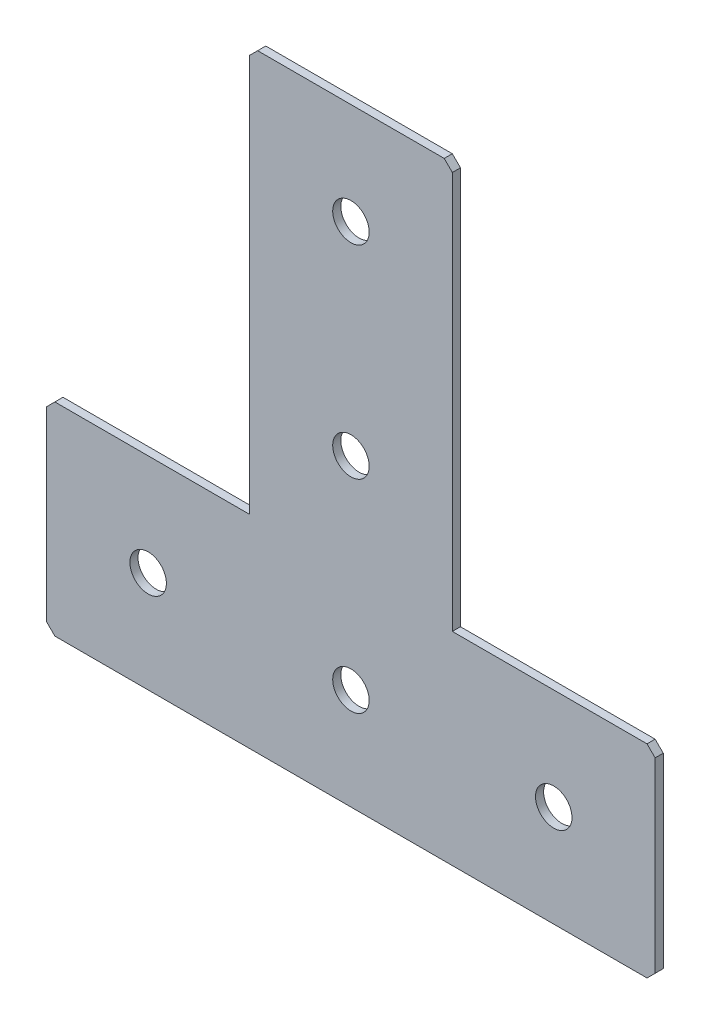
ISO-10303-21;
HEADER;
FILE_DESCRIPTION(('STEP AP214'),'2;1');
FILE_NAME('part.step','',(''),(''),'','','');
FILE_SCHEMA(('AUTOMOTIVE_DESIGN { 1 0 10303 214 1 1 1 1 }'));
ENDSEC;
DATA;
#1=APPLICATION_CONTEXT('core data for automotive mechanical design processes');
#2=APPLICATION_PROTOCOL_DEFINITION('international standard','automotive_design',2000,#1);
#3=PRODUCT_CONTEXT('',#1,'mechanical');
#4=PRODUCT('Part','Part','',(#3));
#5=PRODUCT_RELATED_PRODUCT_CATEGORY('part','',(#4));
#6=PRODUCT_DEFINITION_FORMATION('','',#4);
#7=PRODUCT_DEFINITION_CONTEXT('part definition',#1,'design');
#8=PRODUCT_DEFINITION('design','',#6,#7);
#9=PRODUCT_DEFINITION_SHAPE('','',#8);
#10=(LENGTH_UNIT() NAMED_UNIT(*) SI_UNIT(.MILLI.,.METRE.));
#11=(NAMED_UNIT(*) PLANE_ANGLE_UNIT() SI_UNIT($,.RADIAN.));
#12=(NAMED_UNIT(*) SI_UNIT($,.STERADIAN.) SOLID_ANGLE_UNIT());
#13=UNCERTAINTY_MEASURE_WITH_UNIT(LENGTH_MEASURE(1.E-05),#10,'distance_accuracy_value','');
#14=(GEOMETRIC_REPRESENTATION_CONTEXT(3) GLOBAL_UNCERTAINTY_ASSIGNED_CONTEXT((#13)) GLOBAL_UNIT_ASSIGNED_CONTEXT((#10,
#11,#12)) REPRESENTATION_CONTEXT('',''));
#15=CARTESIAN_POINT('',(0.,0.,0.));
#16=DIRECTION('',(0.,0.,1.));
#17=DIRECTION('',(1.,0.,0.));
#18=AXIS2_PLACEMENT_3D('',#15,#16,#17);
#19=CARTESIAN_POINT('',(-25.,-100.,-2.));
#20=DIRECTION('',(1.,0.,0.));
#21=DIRECTION('',(0.,1.,0.));
#22=AXIS2_PLACEMENT_3D('',#19,#20,#21);
#23=PLANE('',#22);
#24=DIRECTION('',(0.,1.,0.));
#25=VECTOR('',#24,1.);
#26=CARTESIAN_POINT('',(-25.,-100.,0.));
#27=LINE('',#26,#25);
#28=CARTESIAN_POINT('',(-25.,-100.,0.));
#29=VERTEX_POINT('',#28);
#30=CARTESIAN_POINT('',(-25.,-2.,0.));
#31=VERTEX_POINT('',#30);
#32=EDGE_CURVE('E188',#29,#31,#27,.T.);
#33=ORIENTED_EDGE('',*,*,#32,.T.);
#34=DIRECTION('',(0.,0.,-1.));
#35=VECTOR('',#34,1.);
#36=CARTESIAN_POINT('',(-25.,-2.,-2.));
#37=LINE('',#36,#35);
#38=CARTESIAN_POINT('',(-25.,-2.,-2.));
#39=VERTEX_POINT('',#38);
#40=EDGE_CURVE('E278',#31,#39,#37,.T.);
#41=ORIENTED_EDGE('',*,*,#40,.T.);
#42=DIRECTION('',(0.,1.,0.));
#43=VECTOR('',#42,1.);
#44=CARTESIAN_POINT('',(-25.,-100.,-2.));
#45=LINE('',#44,#43);
#46=CARTESIAN_POINT('',(-25.,-100.,-2.));
#47=VERTEX_POINT('',#46);
#48=EDGE_CURVE('E216',#47,#39,#45,.T.);
#49=ORIENTED_EDGE('',*,*,#48,.F.);
#50=DIRECTION('',(0.,0.,1.));
#51=VECTOR('',#50,1.);
#52=CARTESIAN_POINT('',(-25.,-100.,-2.));
#53=LINE('',#52,#51);
#54=EDGE_CURVE('E168',#47,#29,#53,.T.);
#55=ORIENTED_EDGE('',*,*,#54,.T.);
#56=EDGE_LOOP('',(#33,#41,#49,#55));
#57=FACE_BOUND('',#56,.T.);
#58=ADVANCED_FACE('F39',(#57),#23,.F.);
#59=CARTESIAN_POINT('',(25.,0.,-2.));
#60=DIRECTION('',(0.,-1.,0.));
#61=DIRECTION('',(1.,0.,0.));
#62=AXIS2_PLACEMENT_3D('',#59,#60,#61);
#63=PLANE('',#62);
#64=DIRECTION('',(1.,0.,0.));
#65=VECTOR('',#64,1.);
#66=CARTESIAN_POINT('',(25.,0.,-2.));
#67=LINE('',#66,#65);
#68=CARTESIAN_POINT('',(-23.,0.,-2.));
#69=VERTEX_POINT('',#68);
#70=CARTESIAN_POINT('',(23.,0.,-2.));
#71=VERTEX_POINT('',#70);
#72=EDGE_CURVE('E156',#69,#71,#67,.T.);
#73=ORIENTED_EDGE('',*,*,#72,.F.);
#74=DIRECTION('',(0.,0.,1.));
#75=VECTOR('',#74,1.);
#76=CARTESIAN_POINT('',(-23.,0.,-2.));
#77=LINE('',#76,#75);
#78=CARTESIAN_POINT('',(-23.,0.,0.));
#79=VERTEX_POINT('',#78);
#80=EDGE_CURVE('E274',#69,#79,#77,.T.);
#81=ORIENTED_EDGE('',*,*,#80,.T.);
#82=DIRECTION('',(1.,0.,0.));
#83=VECTOR('',#82,1.);
#84=CARTESIAN_POINT('',(25.,0.,0.));
#85=LINE('',#84,#83);
#86=CARTESIAN_POINT('',(23.,0.,0.));
#87=VERTEX_POINT('',#86);
#88=EDGE_CURVE('E192',#79,#87,#85,.T.);
#89=ORIENTED_EDGE('',*,*,#88,.T.);
#90=DIRECTION('',(0.,0.,-1.));
#91=VECTOR('',#90,1.);
#92=CARTESIAN_POINT('',(23.,0.,-2.));
#93=LINE('',#92,#91);
#94=EDGE_CURVE('E271',#87,#71,#93,.T.);
#95=ORIENTED_EDGE('',*,*,#94,.T.);
#96=EDGE_LOOP('',(#73,#81,#89,#95));
#97=FACE_BOUND('',#96,.T.);
#98=ADVANCED_FACE('F331',(#97),#63,.F.);
#99=CARTESIAN_POINT('',(25.,-100.,-2.));
#100=DIRECTION('',(-1.,0.,0.));
#101=DIRECTION('',(0.,-1.,0.));
#102=AXIS2_PLACEMENT_3D('',#99,#100,#101);
#103=PLANE('',#102);
#104=DIRECTION('',(0.,-1.,0.));
#105=VECTOR('',#104,1.);
#106=CARTESIAN_POINT('',(25.,-100.,-2.));
#107=LINE('',#106,#105);
#108=CARTESIAN_POINT('',(25.,-2.00000000000003,-2.));
#109=VERTEX_POINT('',#108);
#110=CARTESIAN_POINT('',(25.,-100.,-2.));
#111=VERTEX_POINT('',#110);
#112=EDGE_CURVE('E142',#109,#111,#107,.T.);
#113=ORIENTED_EDGE('',*,*,#112,.F.);
#114=DIRECTION('',(0.,0.,1.));
#115=VECTOR('',#114,1.);
#116=CARTESIAN_POINT('',(25.,-2.00000000000003,-2.));
#117=LINE('',#116,#115);
#118=CARTESIAN_POINT('',(25.,-2.00000000000003,0.));
#119=VERTEX_POINT('',#118);
#120=EDGE_CURVE('E281',#109,#119,#117,.T.);
#121=ORIENTED_EDGE('',*,*,#120,.T.);
#122=DIRECTION('',(0.,-1.,0.));
#123=VECTOR('',#122,1.);
#124=CARTESIAN_POINT('',(25.,-100.,0.));
#125=LINE('',#124,#123);
#126=CARTESIAN_POINT('',(25.,-100.,0.));
#127=VERTEX_POINT('',#126);
#128=EDGE_CURVE('E162',#119,#127,#125,.T.);
#129=ORIENTED_EDGE('',*,*,#128,.T.);
#130=DIRECTION('',(0.,0.,1.));
#131=VECTOR('',#130,1.);
#132=CARTESIAN_POINT('',(25.,-100.,-2.));
#133=LINE('',#132,#131);
#134=EDGE_CURVE('E159',#111,#127,#133,.T.);
#135=ORIENTED_EDGE('',*,*,#134,.F.);
#136=EDGE_LOOP('',(#113,#121,#129,#135));
#137=FACE_BOUND('',#136,.T.);
#138=ADVANCED_FACE('F160',(#137),#103,.F.);
#139=CARTESIAN_POINT('',(75.,-100.,-2.));
#140=DIRECTION('',(0.,-1.,0.));
#141=DIRECTION('',(0.,0.,-1.));
#142=AXIS2_PLACEMENT_3D('',#139,#140,#141);
#143=PLANE('',#142);
#144=DIRECTION('',(1.,0.,0.));
#145=VECTOR('',#144,1.);
#146=CARTESIAN_POINT('',(75.,-100.,0.));
#147=LINE('',#146,#145);
#148=CARTESIAN_POINT('',(73.,-100.,0.));
#149=VERTEX_POINT('',#148);
#150=EDGE_CURVE('E199',#127,#149,#147,.T.);
#151=ORIENTED_EDGE('',*,*,#150,.T.);
#152=DIRECTION('',(0.,0.,-1.));
#153=VECTOR('',#152,1.);
#154=CARTESIAN_POINT('',(73.,-100.,-2.));
#155=LINE('',#154,#153);
#156=CARTESIAN_POINT('',(73.,-100.,-2.));
#157=VERTEX_POINT('',#156);
#158=EDGE_CURVE('E11',#149,#157,#155,.T.);
#159=ORIENTED_EDGE('',*,*,#158,.T.);
#160=DIRECTION('',(1.,0.,0.));
#161=VECTOR('',#160,1.);
#162=CARTESIAN_POINT('',(75.,-100.,-2.));
#163=LINE('',#162,#161);
#164=EDGE_CURVE('E147',#111,#157,#163,.T.);
#165=ORIENTED_EDGE('',*,*,#164,.F.);
#166=ORIENTED_EDGE('',*,*,#134,.T.);
#167=EDGE_LOOP('',(#151,#159,#165,#166));
#168=FACE_BOUND('',#167,.T.);
#169=ADVANCED_FACE('F170',(#168),#143,.F.);
#170=CARTESIAN_POINT('',(75.,-150.,-2.));
#171=DIRECTION('',(-1.,0.,0.));
#172=DIRECTION('',(0.,-1.,0.));
#173=AXIS2_PLACEMENT_3D('',#170,#171,#172);
#174=PLANE('',#173);
#175=DIRECTION('',(0.,-1.,0.));
#176=VECTOR('',#175,1.);
#177=CARTESIAN_POINT('',(75.,-150.,-2.));
#178=LINE('',#177,#176);
#179=CARTESIAN_POINT('',(75.,-102.,-2.));
#180=VERTEX_POINT('',#179);
#181=CARTESIAN_POINT('',(75.,-148.,-2.));
#182=VERTEX_POINT('',#181);
#183=EDGE_CURVE('E173',#180,#182,#178,.T.);
#184=ORIENTED_EDGE('',*,*,#183,.F.);
#185=DIRECTION('',(0.,0.,1.));
#186=VECTOR('',#185,1.);
#187=CARTESIAN_POINT('',(75.,-102.,-2.));
#188=LINE('',#187,#186);
#189=CARTESIAN_POINT('',(75.,-102.,0.));
#190=VERTEX_POINT('',#189);
#191=EDGE_CURVE('E48',#180,#190,#188,.T.);
#192=ORIENTED_EDGE('',*,*,#191,.T.);
#193=DIRECTION('',(0.,-1.,0.));
#194=VECTOR('',#193,1.);
#195=CARTESIAN_POINT('',(75.,-150.,0.));
#196=LINE('',#195,#194);
#197=CARTESIAN_POINT('',(75.,-148.,0.));
#198=VERTEX_POINT('',#197);
#199=EDGE_CURVE('E202',#190,#198,#196,.T.);
#200=ORIENTED_EDGE('',*,*,#199,.T.);
#201=DIRECTION('',(0.,0.,-1.));
#202=VECTOR('',#201,1.);
#203=CARTESIAN_POINT('',(75.,-148.,-2.));
#204=LINE('',#203,#202);
#205=EDGE_CURVE('E63',#198,#182,#204,.T.);
#206=ORIENTED_EDGE('',*,*,#205,.T.);
#207=EDGE_LOOP('',(#184,#192,#200,#206));
#208=FACE_BOUND('',#207,.T.);
#209=ADVANCED_FACE('F289',(#208),#174,.F.);
#210=CARTESIAN_POINT('',(-75.,-150.,-2.));
#211=DIRECTION('',(0.,1.,0.));
#212=DIRECTION('',(0.,0.,1.));
#213=AXIS2_PLACEMENT_3D('',#210,#211,#212);
#214=PLANE('',#213);
#215=DIRECTION('',(-1.,0.,0.));
#216=VECTOR('',#215,1.);
#217=CARTESIAN_POINT('',(-75.,-150.,0.));
#218=LINE('',#217,#216);
#219=CARTESIAN_POINT('',(73.0000000000001,-150.,0.));
#220=VERTEX_POINT('',#219);
#221=CARTESIAN_POINT('',(-73.,-150.,0.));
#222=VERTEX_POINT('',#221);
#223=EDGE_CURVE('E205',#220,#222,#218,.T.);
#224=ORIENTED_EDGE('',*,*,#223,.T.);
#225=DIRECTION('',(0.,0.,-1.));
#226=VECTOR('',#225,1.);
#227=CARTESIAN_POINT('',(-73.,-150.,-2.));
#228=LINE('',#227,#226);
#229=CARTESIAN_POINT('',(-73.,-150.,-2.));
#230=VERTEX_POINT('',#229);
#231=EDGE_CURVE('E248',#222,#230,#228,.T.);
#232=ORIENTED_EDGE('',*,*,#231,.T.);
#233=DIRECTION('',(-1.,0.,0.));
#234=VECTOR('',#233,1.);
#235=CARTESIAN_POINT('',(-75.,-150.,-2.));
#236=LINE('',#235,#234);
#237=CARTESIAN_POINT('',(73.0000000000001,-150.,-2.));
#238=VERTEX_POINT('',#237);
#239=EDGE_CURVE('E176',#238,#230,#236,.T.);
#240=ORIENTED_EDGE('',*,*,#239,.F.);
#241=DIRECTION('',(0.,0.,1.));
#242=VECTOR('',#241,1.);
#243=CARTESIAN_POINT('',(73.0000000000001,-150.,-2.));
#244=LINE('',#243,#242);
#245=EDGE_CURVE('E244',#238,#220,#244,.T.);
#246=ORIENTED_EDGE('',*,*,#245,.T.);
#247=EDGE_LOOP('',(#224,#232,#240,#246));
#248=FACE_BOUND('',#247,.T.);
#249=ADVANCED_FACE('F300',(#248),#214,.F.);
#250=CARTESIAN_POINT('',(-75.,-150.,-2.));
#251=DIRECTION('',(1.,0.,0.));
#252=DIRECTION('',(0.,1.,0.));
#253=AXIS2_PLACEMENT_3D('',#250,#251,#252);
#254=PLANE('',#253);
#255=DIRECTION('',(0.,1.,0.));
#256=VECTOR('',#255,1.);
#257=CARTESIAN_POINT('',(-75.,-150.,-2.));
#258=LINE('',#257,#256);
#259=CARTESIAN_POINT('',(-75.,-148.,-2.));
#260=VERTEX_POINT('',#259);
#261=CARTESIAN_POINT('',(-75.,-102.,-2.));
#262=VERTEX_POINT('',#261);
#263=EDGE_CURVE('E182',#260,#262,#258,.T.);
#264=ORIENTED_EDGE('',*,*,#263,.F.);
#265=DIRECTION('',(0.,0.,1.));
#266=VECTOR('',#265,1.);
#267=CARTESIAN_POINT('',(-75.,-148.,-2.));
#268=LINE('',#267,#266);
#269=CARTESIAN_POINT('',(-75.,-148.,0.));
#270=VERTEX_POINT('',#269);
#271=EDGE_CURVE('E222',#260,#270,#268,.T.);
#272=ORIENTED_EDGE('',*,*,#271,.T.);
#273=DIRECTION('',(0.,1.,0.));
#274=VECTOR('',#273,1.);
#275=CARTESIAN_POINT('',(-75.,-150.,0.));
#276=LINE('',#275,#274);
#277=CARTESIAN_POINT('',(-75.,-102.,0.));
#278=VERTEX_POINT('',#277);
#279=EDGE_CURVE('E209',#270,#278,#276,.T.);
#280=ORIENTED_EDGE('',*,*,#279,.T.);
#281=DIRECTION('',(0.,0.,-1.));
#282=VECTOR('',#281,1.);
#283=CARTESIAN_POINT('',(-75.,-102.,-2.));
#284=LINE('',#283,#282);
#285=EDGE_CURVE('E167',#278,#262,#284,.T.);
#286=ORIENTED_EDGE('',*,*,#285,.T.);
#287=EDGE_LOOP('',(#264,#272,#280,#286));
#288=FACE_BOUND('',#287,.T.);
#289=ADVANCED_FACE('F308',(#288),#254,.F.);
#290=CARTESIAN_POINT('',(-75.,-100.,-2.));
#291=DIRECTION('',(0.,-1.,0.));
#292=DIRECTION('',(0.,0.,-1.));
#293=AXIS2_PLACEMENT_3D('',#290,#291,#292);
#294=PLANE('',#293);
#295=DIRECTION('',(1.,0.,0.));
#296=VECTOR('',#295,1.);
#297=CARTESIAN_POINT('',(-75.,-100.,-2.));
#298=LINE('',#297,#296);
#299=CARTESIAN_POINT('',(-73.,-100.,-2.));
#300=VERTEX_POINT('',#299);
#301=EDGE_CURVE('E185',#300,#47,#298,.T.);
#302=ORIENTED_EDGE('',*,*,#301,.F.);
#303=DIRECTION('',(0.,0.,1.));
#304=VECTOR('',#303,1.);
#305=CARTESIAN_POINT('',(-73.,-100.,-2.));
#306=LINE('',#305,#304);
#307=CARTESIAN_POINT('',(-73.,-100.,0.));
#308=VERTEX_POINT('',#307);
#309=EDGE_CURVE('E267',#300,#308,#306,.T.);
#310=ORIENTED_EDGE('',*,*,#309,.T.);
#311=DIRECTION('',(1.,0.,0.));
#312=VECTOR('',#311,1.);
#313=CARTESIAN_POINT('',(-75.,-100.,0.));
#314=LINE('',#313,#312);
#315=EDGE_CURVE('E213',#308,#29,#314,.T.);
#316=ORIENTED_EDGE('',*,*,#315,.T.);
#317=ORIENTED_EDGE('',*,*,#54,.F.);
#318=EDGE_LOOP('',(#302,#310,#316,#317));
#319=FACE_BOUND('',#318,.T.);
#320=ADVANCED_FACE('F316',(#319),#294,.F.);
#321=CARTESIAN_POINT('',(0.,0.,-2.));
#322=DIRECTION('',(0.,0.,1.));
#323=DIRECTION('',(1.,0.,0.));
#324=AXIS2_PLACEMENT_3D('',#321,#322,#323);
#325=PLANE('',#324);
#326=CARTESIAN_POINT('',(0.,-125.,-2.00000000000001));
#327=DIRECTION('',(0.,0.,-1.));
#328=DIRECTION('',(0.,1.,0.));
#329=AXIS2_PLACEMENT_3D('',#326,#327,#328);
#330=CIRCLE('',#329,4.5);
#331=CARTESIAN_POINT('',(0.,-120.5,-2.00000000000001));
#332=VERTEX_POINT('',#331);
#333=EDGE_CURVE('E372',#332,#332,#330,.T.);
#334=ORIENTED_EDGE('',*,*,#333,.F.);
#335=EDGE_LOOP('',(#334));
#336=FACE_BOUND('',#335,.T.);
#337=CARTESIAN_POINT('',(-50.,-125.,-2.00000000000001));
#338=DIRECTION('',(0.,0.,-1.));
#339=DIRECTION('',(0.,1.,0.));
#340=AXIS2_PLACEMENT_3D('',#337,#338,#339);
#341=CIRCLE('',#340,4.5);
#342=CARTESIAN_POINT('',(-50.,-120.5,-2.00000000000001));
#343=VERTEX_POINT('',#342);
#344=EDGE_CURVE('E364',#343,#343,#341,.T.);
#345=ORIENTED_EDGE('',*,*,#344,.F.);
#346=EDGE_LOOP('',(#345));
#347=FACE_BOUND('',#346,.T.);
#348=CARTESIAN_POINT('',(50.,-125.,-2.00000000000001));
#349=DIRECTION('',(0.,0.,-1.));
#350=DIRECTION('',(0.,1.,0.));
#351=AXIS2_PLACEMENT_3D('',#348,#349,#350);
#352=CIRCLE('',#351,4.5);
#353=CARTESIAN_POINT('',(50.,-120.5,-2.00000000000001));
#354=VERTEX_POINT('',#353);
#355=EDGE_CURVE('E356',#354,#354,#352,.T.);
#356=ORIENTED_EDGE('',*,*,#355,.F.);
#357=EDGE_LOOP('',(#356));
#358=FACE_BOUND('',#357,.T.);
#359=CARTESIAN_POINT('',(0.,-75.,-2.));
#360=DIRECTION('',(0.,0.,-1.));
#361=DIRECTION('',(0.,1.,0.));
#362=AXIS2_PLACEMENT_3D('',#359,#360,#361);
#363=CIRCLE('',#362,4.5);
#364=CARTESIAN_POINT('',(0.,-70.5,-2.));
#365=VERTEX_POINT('',#364);
#366=EDGE_CURVE('E348',#365,#365,#363,.T.);
#367=ORIENTED_EDGE('',*,*,#366,.F.);
#368=EDGE_LOOP('',(#367));
#369=FACE_BOUND('',#368,.T.);
#370=CARTESIAN_POINT('',(0.,-25.,-2.));
#371=DIRECTION('',(0.,0.,-1.));
#372=DIRECTION('',(0.,1.,0.));
#373=AXIS2_PLACEMENT_3D('',#370,#371,#372);
#374=CIRCLE('',#373,4.5);
#375=CARTESIAN_POINT('',(0.,-20.5,-2.));
#376=VERTEX_POINT('',#375);
#377=EDGE_CURVE('E340',#376,#376,#374,.T.);
#378=ORIENTED_EDGE('',*,*,#377,.F.);
#379=EDGE_LOOP('',(#378));
#380=FACE_BOUND('',#379,.T.);
#381=ORIENTED_EDGE('',*,*,#239,.T.);
#382=DIRECTION('',(0.707106781186548,-0.707106781186548,0.));
#383=VECTOR('',#382,1.);
#384=CARTESIAN_POINT('',(-75.,-148.,-2.));
#385=LINE('',#384,#383);
#386=EDGE_CURVE('E264',#230,#260,#385,.F.);
#387=ORIENTED_EDGE('',*,*,#386,.T.);
#388=ORIENTED_EDGE('',*,*,#263,.T.);
#389=DIRECTION('',(-0.707106781186552,-0.707106781186543,0.));
#390=VECTOR('',#389,1.);
#391=CARTESIAN_POINT('',(-73.,-100.,-2.));
#392=LINE('',#391,#390);
#393=EDGE_CURVE('E55',#262,#300,#392,.F.);
#394=ORIENTED_EDGE('',*,*,#393,.T.);
#395=ORIENTED_EDGE('',*,*,#301,.T.);
#396=ORIENTED_EDGE('',*,*,#48,.T.);
#397=DIRECTION('',(-0.707106781186547,-0.707106781186549,0.));
#398=VECTOR('',#397,1.);
#399=CARTESIAN_POINT('',(-23.,0.,-2.));
#400=LINE('',#399,#398);
#401=EDGE_CURVE('E259',#39,#69,#400,.F.);
#402=ORIENTED_EDGE('',*,*,#401,.T.);
#403=ORIENTED_EDGE('',*,*,#72,.T.);
#404=DIRECTION('',(-0.707106781186547,0.707106781186548,0.));
#405=VECTOR('',#404,1.);
#406=CARTESIAN_POINT('',(25.,-2.00000000000003,-2.));
#407=LINE('',#406,#405);
#408=EDGE_CURVE('E151',#71,#109,#407,.F.);
#409=ORIENTED_EDGE('',*,*,#408,.T.);
#410=ORIENTED_EDGE('',*,*,#112,.T.);
#411=ORIENTED_EDGE('',*,*,#164,.T.);
#412=DIRECTION('',(-0.707106781186552,0.707106781186543,0.));
#413=VECTOR('',#412,1.);
#414=CARTESIAN_POINT('',(75.,-102.,-2.));
#415=LINE('',#414,#413);
#416=EDGE_CURVE('E254',#157,#180,#415,.F.);
#417=ORIENTED_EDGE('',*,*,#416,.T.);
#418=ORIENTED_EDGE('',*,*,#183,.T.);
#419=DIRECTION('',(0.707106781186543,0.707106781186552,0.));
#420=VECTOR('',#419,1.);
#421=CARTESIAN_POINT('',(73.0000000000001,-150.,-2.));
#422=LINE('',#421,#420);
#423=EDGE_CURVE('E251',#182,#238,#422,.F.);
#424=ORIENTED_EDGE('',*,*,#423,.T.);
#425=EDGE_LOOP('',(#381,#387,#388,#394,#395,#396,#402,#403,#409,#410,#411,#417,#418,#424));
#426=FACE_BOUND('',#425,.T.);
#427=ADVANCED_FACE('F145',(#336,#347,#358,#369,#380,#426),#325,.F.);
#428=CARTESIAN_POINT('',(0.,0.,0.));
#429=DIRECTION('',(0.,0.,1.));
#430=DIRECTION('',(1.,0.,0.));
#431=AXIS2_PLACEMENT_3D('',#428,#429,#430);
#432=PLANE('',#431);
#433=CARTESIAN_POINT('',(0.,-125.,0.));
#434=DIRECTION('',(0.,0.,-1.));
#435=DIRECTION('',(0.,1.,0.));
#436=AXIS2_PLACEMENT_3D('',#433,#434,#435);
#437=CIRCLE('',#436,4.5);
#438=CARTESIAN_POINT('',(0.,-120.5,0.));
#439=VERTEX_POINT('',#438);
#440=EDGE_CURVE('E368',#439,#439,#437,.T.);
#441=ORIENTED_EDGE('',*,*,#440,.T.);
#442=EDGE_LOOP('',(#441));
#443=FACE_BOUND('',#442,.T.);
#444=CARTESIAN_POINT('',(-50.,-125.,0.));
#445=DIRECTION('',(0.,0.,-1.));
#446=DIRECTION('',(0.,1.,0.));
#447=AXIS2_PLACEMENT_3D('',#444,#445,#446);
#448=CIRCLE('',#447,4.5);
#449=CARTESIAN_POINT('',(-50.,-120.5,0.));
#450=VERTEX_POINT('',#449);
#451=EDGE_CURVE('E360',#450,#450,#448,.T.);
#452=ORIENTED_EDGE('',*,*,#451,.T.);
#453=EDGE_LOOP('',(#452));
#454=FACE_BOUND('',#453,.T.);
#455=CARTESIAN_POINT('',(50.,-125.,0.));
#456=DIRECTION('',(0.,0.,-1.));
#457=DIRECTION('',(0.,1.,0.));
#458=AXIS2_PLACEMENT_3D('',#455,#456,#457);
#459=CIRCLE('',#458,4.5);
#460=CARTESIAN_POINT('',(50.,-120.5,0.));
#461=VERTEX_POINT('',#460);
#462=EDGE_CURVE('E352',#461,#461,#459,.T.);
#463=ORIENTED_EDGE('',*,*,#462,.T.);
#464=EDGE_LOOP('',(#463));
#465=FACE_BOUND('',#464,.T.);
#466=CARTESIAN_POINT('',(0.,-75.,0.));
#467=DIRECTION('',(0.,0.,-1.));
#468=DIRECTION('',(0.,1.,0.));
#469=AXIS2_PLACEMENT_3D('',#466,#467,#468);
#470=CIRCLE('',#469,4.5);
#471=CARTESIAN_POINT('',(0.,-70.5,0.));
#472=VERTEX_POINT('',#471);
#473=EDGE_CURVE('E344',#472,#472,#470,.T.);
#474=ORIENTED_EDGE('',*,*,#473,.T.);
#475=EDGE_LOOP('',(#474));
#476=FACE_BOUND('',#475,.T.);
#477=CARTESIAN_POINT('',(0.,-25.,0.));
#478=DIRECTION('',(0.,0.,-1.));
#479=DIRECTION('',(0.,1.,0.));
#480=AXIS2_PLACEMENT_3D('',#477,#478,#479);
#481=CIRCLE('',#480,4.5);
#482=CARTESIAN_POINT('',(0.,-20.5,0.));
#483=VERTEX_POINT('',#482);
#484=EDGE_CURVE('E193',#483,#483,#481,.T.);
#485=ORIENTED_EDGE('',*,*,#484,.T.);
#486=EDGE_LOOP('',(#485));
#487=FACE_BOUND('',#486,.T.);
#488=ORIENTED_EDGE('',*,*,#279,.F.);
#489=DIRECTION('',(-0.707106781186548,0.707106781186548,0.));
#490=VECTOR('',#489,1.);
#491=CARTESIAN_POINT('',(-111.5,-111.5,0.));
#492=LINE('',#491,#490);
#493=EDGE_CURVE('E241',#270,#222,#492,.F.);
#494=ORIENTED_EDGE('',*,*,#493,.T.);
#495=ORIENTED_EDGE('',*,*,#223,.F.);
#496=DIRECTION('',(-0.707106781186543,-0.707106781186552,0.));
#497=VECTOR('',#496,1.);
#498=CARTESIAN_POINT('',(111.500000000001,-111.499999999999,0.));
#499=LINE('',#498,#497);
#500=EDGE_CURVE('E226',#220,#198,#499,.F.);
#501=ORIENTED_EDGE('',*,*,#500,.T.);
#502=ORIENTED_EDGE('',*,*,#199,.F.);
#503=DIRECTION('',(0.707106781186552,-0.707106781186543,0.));
#504=VECTOR('',#503,1.);
#505=CARTESIAN_POINT('',(-13.5000000000005,-13.5000000000007,0.));
#506=LINE('',#505,#504);
#507=EDGE_CURVE('E229',#190,#149,#506,.F.);
#508=ORIENTED_EDGE('',*,*,#507,.T.);
#509=ORIENTED_EDGE('',*,*,#150,.F.);
#510=ORIENTED_EDGE('',*,*,#128,.F.);
#511=DIRECTION('',(0.707106781186547,-0.707106781186548,0.));
#512=VECTOR('',#511,1.);
#513=CARTESIAN_POINT('',(11.5,11.5,0.));
#514=LINE('',#513,#512);
#515=EDGE_CURVE('E232',#119,#87,#514,.F.);
#516=ORIENTED_EDGE('',*,*,#515,.T.);
#517=ORIENTED_EDGE('',*,*,#88,.F.);
#518=DIRECTION('',(0.707106781186547,0.707106781186549,0.));
#519=VECTOR('',#518,1.);
#520=CARTESIAN_POINT('',(-11.5,11.5,0.));
#521=LINE('',#520,#519);
#522=EDGE_CURVE('E235',#79,#31,#521,.F.);
#523=ORIENTED_EDGE('',*,*,#522,.T.);
#524=ORIENTED_EDGE('',*,*,#32,.F.);
#525=ORIENTED_EDGE('',*,*,#315,.F.);
#526=DIRECTION('',(0.707106781186552,0.707106781186543,0.));
#527=VECTOR('',#526,1.);
#528=CARTESIAN_POINT('',(13.5000000000005,-13.5000000000007,0.));
#529=LINE('',#528,#527);
#530=EDGE_CURVE('E238',#308,#278,#529,.F.);
#531=ORIENTED_EDGE('',*,*,#530,.T.);
#532=EDGE_LOOP('',(#488,#494,#495,#501,#502,#508,#509,#510,#516,#517,#523,#524,#525,#531));
#533=FACE_BOUND('',#532,.T.);
#534=ADVANCED_FACE('F293',(#443,#454,#465,#476,#487,#533),#432,.T.);
#535=CARTESIAN_POINT('',(0.,-25.,-2.));
#536=DIRECTION('',(0.,0.,-1.));
#537=DIRECTION('',(0.,1.,0.));
#538=AXIS2_PLACEMENT_3D('',#535,#536,#537);
#539=CYLINDRICAL_SURFACE('',#538,4.5);
#540=ORIENTED_EDGE('',*,*,#484,.F.);
#541=EDGE_LOOP('',(#540));
#542=FACE_BOUND('',#541,.T.);
#543=ORIENTED_EDGE('',*,*,#377,.T.);
#544=EDGE_LOOP('',(#543));
#545=FACE_BOUND('',#544,.T.);
#546=ADVANCED_FACE('F390',(#542,#545),#539,.F.);
#547=CARTESIAN_POINT('',(0.,-75.,-2.));
#548=DIRECTION('',(0.,0.,-1.));
#549=DIRECTION('',(0.,1.,0.));
#550=AXIS2_PLACEMENT_3D('',#547,#548,#549);
#551=CYLINDRICAL_SURFACE('',#550,4.5);
#552=ORIENTED_EDGE('',*,*,#473,.F.);
#553=EDGE_LOOP('',(#552));
#554=FACE_BOUND('',#553,.T.);
#555=ORIENTED_EDGE('',*,*,#366,.T.);
#556=EDGE_LOOP('',(#555));
#557=FACE_BOUND('',#556,.T.);
#558=ADVANCED_FACE('F392',(#554,#557),#551,.F.);
#559=CARTESIAN_POINT('',(50.,-125.,-2.00000000000001));
#560=DIRECTION('',(0.,0.,-1.));
#561=DIRECTION('',(0.,1.,0.));
#562=AXIS2_PLACEMENT_3D('',#559,#560,#561);
#563=CYLINDRICAL_SURFACE('',#562,4.5);
#564=ORIENTED_EDGE('',*,*,#462,.F.);
#565=EDGE_LOOP('',(#564));
#566=FACE_BOUND('',#565,.T.);
#567=ORIENTED_EDGE('',*,*,#355,.T.);
#568=EDGE_LOOP('',(#567));
#569=FACE_BOUND('',#568,.T.);
#570=ADVANCED_FACE('F399',(#566,#569),#563,.F.);
#571=CARTESIAN_POINT('',(-50.,-125.,-2.00000000000001));
#572=DIRECTION('',(0.,0.,-1.));
#573=DIRECTION('',(0.,1.,0.));
#574=AXIS2_PLACEMENT_3D('',#571,#572,#573);
#575=CYLINDRICAL_SURFACE('',#574,4.5);
#576=ORIENTED_EDGE('',*,*,#451,.F.);
#577=EDGE_LOOP('',(#576));
#578=FACE_BOUND('',#577,.T.);
#579=ORIENTED_EDGE('',*,*,#344,.T.);
#580=EDGE_LOOP('',(#579));
#581=FACE_BOUND('',#580,.T.);
#582=ADVANCED_FACE('F534',(#578,#581),#575,.F.);
#583=CARTESIAN_POINT('',(0.,-125.,-2.00000000000001));
#584=DIRECTION('',(0.,0.,-1.));
#585=DIRECTION('',(0.,1.,0.));
#586=AXIS2_PLACEMENT_3D('',#583,#584,#585);
#587=CYLINDRICAL_SURFACE('',#586,4.5);
#588=ORIENTED_EDGE('',*,*,#440,.F.);
#589=EDGE_LOOP('',(#588));
#590=FACE_BOUND('',#589,.T.);
#591=ORIENTED_EDGE('',*,*,#333,.T.);
#592=EDGE_LOOP('',(#591));
#593=FACE_BOUND('',#592,.T.);
#594=ADVANCED_FACE('F377',(#590,#593),#587,.F.);
#595=CARTESIAN_POINT('',(-75.,-148.,-2.));
#596=DIRECTION('',(0.707106781186547,0.707106781186547,0.));
#597=DIRECTION('',(0.,0.,1.));
#598=AXIS2_PLACEMENT_3D('',#595,#596,#597);
#599=PLANE('',#598);
#600=ORIENTED_EDGE('',*,*,#386,.F.);
#601=ORIENTED_EDGE('',*,*,#231,.F.);
#602=ORIENTED_EDGE('',*,*,#493,.F.);
#603=ORIENTED_EDGE('',*,*,#271,.F.);
#604=EDGE_LOOP('',(#600,#601,#602,#603));
#605=FACE_BOUND('',#604,.T.);
#606=ADVANCED_FACE('F306',(#605),#599,.F.);
#607=CARTESIAN_POINT('',(-73.,-100.,-2.));
#608=DIRECTION('',(0.707106781186542,-0.707106781186552,0.));
#609=DIRECTION('',(0.,0.,1.));
#610=AXIS2_PLACEMENT_3D('',#607,#608,#609);
#611=PLANE('',#610);
#612=ORIENTED_EDGE('',*,*,#393,.F.);
#613=ORIENTED_EDGE('',*,*,#285,.F.);
#614=ORIENTED_EDGE('',*,*,#530,.F.);
#615=ORIENTED_EDGE('',*,*,#309,.F.);
#616=EDGE_LOOP('',(#612,#613,#614,#615));
#617=FACE_BOUND('',#616,.T.);
#618=ADVANCED_FACE('F314',(#617),#611,.F.);
#619=CARTESIAN_POINT('',(-23.,0.,-2.));
#620=DIRECTION('',(0.707106781186549,-0.707106781186547,0.));
#621=DIRECTION('',(0.,0.,1.));
#622=AXIS2_PLACEMENT_3D('',#619,#620,#621);
#623=PLANE('',#622);
#624=ORIENTED_EDGE('',*,*,#401,.F.);
#625=ORIENTED_EDGE('',*,*,#40,.F.);
#626=ORIENTED_EDGE('',*,*,#522,.F.);
#627=ORIENTED_EDGE('',*,*,#80,.F.);
#628=EDGE_LOOP('',(#624,#625,#626,#627));
#629=FACE_BOUND('',#628,.T.);
#630=ADVANCED_FACE('F328',(#629),#623,.F.);
#631=CARTESIAN_POINT('',(25.,-2.00000000000003,-2.));
#632=DIRECTION('',(-0.707106781186548,-0.707106781186547,0.));
#633=DIRECTION('',(0.,0.,1.));
#634=AXIS2_PLACEMENT_3D('',#631,#632,#633);
#635=PLANE('',#634);
#636=ORIENTED_EDGE('',*,*,#408,.F.);
#637=ORIENTED_EDGE('',*,*,#94,.F.);
#638=ORIENTED_EDGE('',*,*,#515,.F.);
#639=ORIENTED_EDGE('',*,*,#120,.F.);
#640=EDGE_LOOP('',(#636,#637,#638,#639));
#641=FACE_BOUND('',#640,.T.);
#642=ADVANCED_FACE('F334',(#641),#635,.F.);
#643=CARTESIAN_POINT('',(75.,-102.,-2.));
#644=DIRECTION('',(-0.707106781186543,-0.707106781186552,0.));
#645=DIRECTION('',(0.,0.,1.));
#646=AXIS2_PLACEMENT_3D('',#643,#644,#645);
#647=PLANE('',#646);
#648=ORIENTED_EDGE('',*,*,#416,.F.);
#649=ORIENTED_EDGE('',*,*,#158,.F.);
#650=ORIENTED_EDGE('',*,*,#507,.F.);
#651=ORIENTED_EDGE('',*,*,#191,.F.);
#652=EDGE_LOOP('',(#648,#649,#650,#651));
#653=FACE_BOUND('',#652,.T.);
#654=ADVANCED_FACE('F420',(#653),#647,.F.);
#655=CARTESIAN_POINT('',(73.0000000000001,-150.,-2.));
#656=DIRECTION('',(-0.707106781186552,0.707106781186543,0.));
#657=DIRECTION('',(0.,0.,1.));
#658=AXIS2_PLACEMENT_3D('',#655,#656,#657);
#659=PLANE('',#658);
#660=ORIENTED_EDGE('',*,*,#423,.F.);
#661=ORIENTED_EDGE('',*,*,#205,.F.);
#662=ORIENTED_EDGE('',*,*,#500,.F.);
#663=ORIENTED_EDGE('',*,*,#245,.F.);
#664=EDGE_LOOP('',(#660,#661,#662,#663));
#665=FACE_BOUND('',#664,.T.);
#666=ADVANCED_FACE('F41',(#665),#659,.F.);
#667=CLOSED_SHELL('',(#58,#98,#138,#169,#209,#249,#289,#320,#427,#534,#546,#558,#570,#582,#594,
#606,#618,#630,#642,#654,#666));
#668=MANIFOLD_SOLID_BREP('B2',#667);
#669=ADVANCED_BREP_SHAPE_REPRESENTATION('',(#18,#668),#14);
#670=SHAPE_DEFINITION_REPRESENTATION(#9,#669);
ENDSEC;
END-ISO-10303-21;
